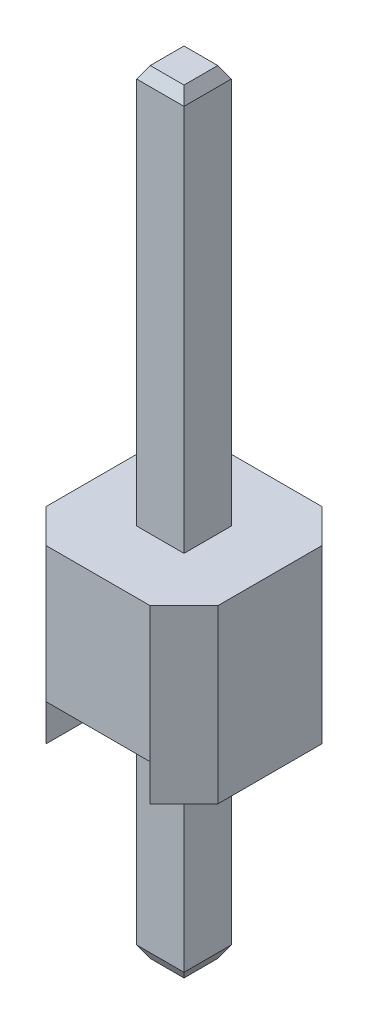
ISO-10303-21;
HEADER;
FILE_DESCRIPTION(('STEP AP214'),'2;1');
FILE_NAME('part.step','',(''),(''),'','','');
FILE_SCHEMA(('AUTOMOTIVE_DESIGN { 1 0 10303 214 1 1 1 1 }'));
ENDSEC;
DATA;
#1=APPLICATION_CONTEXT('core data for automotive mechanical design processes');
#2=APPLICATION_PROTOCOL_DEFINITION('international standard','automotive_design',2000,#1);
#3=PRODUCT_CONTEXT('',#1,'mechanical');
#4=PRODUCT('Part','Part','',(#3));
#5=PRODUCT_RELATED_PRODUCT_CATEGORY('part','',(#4));
#6=PRODUCT_DEFINITION_FORMATION('','',#4);
#7=PRODUCT_DEFINITION_CONTEXT('part definition',#1,'design');
#8=PRODUCT_DEFINITION('design','',#6,#7);
#9=PRODUCT_DEFINITION_SHAPE('','',#8);
#10=(LENGTH_UNIT() NAMED_UNIT(*) SI_UNIT(.MILLI.,.METRE.));
#11=(NAMED_UNIT(*) PLANE_ANGLE_UNIT() SI_UNIT($,.RADIAN.));
#12=(NAMED_UNIT(*) SI_UNIT($,.STERADIAN.) SOLID_ANGLE_UNIT());
#13=UNCERTAINTY_MEASURE_WITH_UNIT(LENGTH_MEASURE(1.E-05),#10,'distance_accuracy_value','');
#14=(GEOMETRIC_REPRESENTATION_CONTEXT(3) GLOBAL_UNCERTAINTY_ASSIGNED_CONTEXT((#13)) GLOBAL_UNIT_ASSIGNED_CONTEXT((#10,
#11,#12)) REPRESENTATION_CONTEXT('',''));
#15=CARTESIAN_POINT('',(0.,0.,0.));
#16=DIRECTION('',(0.,0.,1.));
#17=DIRECTION('',(1.,0.,0.));
#18=AXIS2_PLACEMENT_3D('',#15,#16,#17);
#19=CARTESIAN_POINT('',(-0.35,-2.82679491924311,-0.35));
#20=DIRECTION('',(0.,-0.5,-0.866025403784438));
#21=DIRECTION('',(0.,0.866025403784438,-0.5));
#22=AXIS2_PLACEMENT_3D('',#19,#20,#21);
#23=PLANE('',#22);
#24=DIRECTION('',(0.447213595499958,-0.774596669241483,0.447213595499958));
#25=VECTOR('',#24,1.);
#26=CARTESIAN_POINT('',(-0.35,-2.82679491924311,-0.35));
#27=LINE('',#26,#25);
#28=CARTESIAN_POINT('',(-0.35,-2.82679491924311,-0.35));
#29=VERTEX_POINT('',#28);
#30=CARTESIAN_POINT('',(-0.250000000000001,-3.,-0.250000000000001));
#31=VERTEX_POINT('',#30);
#32=EDGE_CURVE('E19',#29,#31,#27,.T.);
#33=ORIENTED_EDGE('',*,*,#32,.F.);
#34=DIRECTION('',(-1.,0.,0.));
#35=VECTOR('',#34,1.);
#36=CARTESIAN_POINT('',(-0.35,-2.82679491924311,-0.35));
#37=LINE('',#36,#35);
#38=CARTESIAN_POINT('',(0.35,-2.82679491924311,-0.35));
#39=VERTEX_POINT('',#38);
#40=EDGE_CURVE('E188',#39,#29,#37,.T.);
#41=ORIENTED_EDGE('',*,*,#40,.F.);
#42=DIRECTION('',(0.447213595499958,0.774596669241483,-0.447213595499958));
#43=VECTOR('',#42,1.);
#44=CARTESIAN_POINT('',(0.250000000000001,-3.,-0.250000000000001));
#45=LINE('',#44,#43);
#46=CARTESIAN_POINT('',(0.250000000000001,-3.,-0.250000000000001));
#47=VERTEX_POINT('',#46);
#48=EDGE_CURVE('E169',#47,#39,#45,.T.);
#49=ORIENTED_EDGE('',*,*,#48,.F.);
#50=DIRECTION('',(1.,0.,0.));
#51=VECTOR('',#50,1.);
#52=CARTESIAN_POINT('',(0.,-3.,-0.250000000000001));
#53=LINE('',#52,#51);
#54=EDGE_CURVE('E163',#47,#31,#53,.F.);
#55=ORIENTED_EDGE('',*,*,#54,.T.);
#56=EDGE_LOOP('',(#33,#41,#49,#55));
#57=FACE_BOUND('',#56,.T.);
#58=ADVANCED_FACE('F16',(#57),#23,.T.);
#59=CARTESIAN_POINT('',(-0.35,-2.82679491924311,-0.35));
#60=DIRECTION('',(-0.866025403784438,-0.5,0.));
#61=DIRECTION('',(0.5,-0.866025403784438,0.));
#62=AXIS2_PLACEMENT_3D('',#59,#60,#61);
#63=PLANE('',#62);
#64=DIRECTION('',(0.447213595499958,-0.774596669241483,-0.447213595499958));
#65=VECTOR('',#64,1.);
#66=CARTESIAN_POINT('',(-0.35,-2.82679491924311,0.35));
#67=LINE('',#66,#65);
#68=CARTESIAN_POINT('',(-0.35,-2.82679491924311,0.35));
#69=VERTEX_POINT('',#68);
#70=CARTESIAN_POINT('',(-0.250000000000001,-3.,0.250000000000001));
#71=VERTEX_POINT('',#70);
#72=EDGE_CURVE('E201',#69,#71,#67,.T.);
#73=ORIENTED_EDGE('',*,*,#72,.F.);
#74=DIRECTION('',(0.,0.,1.));
#75=VECTOR('',#74,1.);
#76=CARTESIAN_POINT('',(-0.35,-2.82679491924311,-0.35));
#77=LINE('',#76,#75);
#78=EDGE_CURVE('E177',#29,#69,#77,.T.);
#79=ORIENTED_EDGE('',*,*,#78,.F.);
#80=ORIENTED_EDGE('',*,*,#32,.T.);
#81=DIRECTION('',(0.,0.,1.));
#82=VECTOR('',#81,1.);
#83=CARTESIAN_POINT('',(-0.250000000000001,-3.,0.));
#84=LINE('',#83,#82);
#85=EDGE_CURVE('E171',#31,#71,#84,.T.);
#86=ORIENTED_EDGE('',*,*,#85,.T.);
#87=EDGE_LOOP('',(#73,#79,#80,#86));
#88=FACE_BOUND('',#87,.T.);
#89=ADVANCED_FACE('F174',(#88),#63,.T.);
#90=CARTESIAN_POINT('',(0.,-3.,0.));
#91=DIRECTION('',(0.,1.,0.));
#92=DIRECTION('',(0.,0.,1.));
#93=AXIS2_PLACEMENT_3D('',#90,#91,#92);
#94=PLANE('',#93);
#95=ORIENTED_EDGE('',*,*,#85,.F.);
#96=ORIENTED_EDGE('',*,*,#54,.F.);
#97=DIRECTION('',(0.,0.,1.));
#98=VECTOR('',#97,1.);
#99=CARTESIAN_POINT('',(0.250000000000001,-3.,-0.35));
#100=LINE('',#99,#98);
#101=CARTESIAN_POINT('',(0.250000000000001,-3.,0.250000000000001));
#102=VERTEX_POINT('',#101);
#103=EDGE_CURVE('E183',#102,#47,#100,.F.);
#104=ORIENTED_EDGE('',*,*,#103,.F.);
#105=DIRECTION('',(1.,0.,0.));
#106=VECTOR('',#105,1.);
#107=CARTESIAN_POINT('',(-0.35,-3.,0.250000000000001));
#108=LINE('',#107,#106);
#109=EDGE_CURVE('E181',#71,#102,#108,.T.);
#110=ORIENTED_EDGE('',*,*,#109,.F.);
#111=EDGE_LOOP('',(#95,#96,#104,#110));
#112=FACE_BOUND('',#111,.T.);
#113=ADVANCED_FACE('F179',(#112),#94,.F.);
#114=CARTESIAN_POINT('',(0.35,-2.82679491924311,-0.35));
#115=DIRECTION('',(0.866025403784438,-0.5,0.));
#116=DIRECTION('',(0.5,0.866025403784438,0.));
#117=AXIS2_PLACEMENT_3D('',#114,#115,#116);
#118=PLANE('',#117);
#119=ORIENTED_EDGE('',*,*,#48,.T.);
#120=DIRECTION('',(0.,0.,-1.));
#121=VECTOR('',#120,1.);
#122=CARTESIAN_POINT('',(0.35,-2.82679491924311,-0.35));
#123=LINE('',#122,#121);
#124=CARTESIAN_POINT('',(0.35,-2.82679491924311,0.35));
#125=VERTEX_POINT('',#124);
#126=EDGE_CURVE('E204',#125,#39,#123,.T.);
#127=ORIENTED_EDGE('',*,*,#126,.F.);
#128=DIRECTION('',(0.447213595499958,0.774596669241483,0.447213595499958));
#129=VECTOR('',#128,1.);
#130=CARTESIAN_POINT('',(0.250000000000001,-3.,0.250000000000001));
#131=LINE('',#130,#129);
#132=EDGE_CURVE('E198',#102,#125,#131,.T.);
#133=ORIENTED_EDGE('',*,*,#132,.F.);
#134=ORIENTED_EDGE('',*,*,#103,.T.);
#135=EDGE_LOOP('',(#119,#127,#133,#134));
#136=FACE_BOUND('',#135,.T.);
#137=ADVANCED_FACE('F680',(#136),#118,.T.);
#138=CARTESIAN_POINT('',(-0.35,-3.,-0.35));
#139=DIRECTION('',(0.,0.,-1.));
#140=DIRECTION('',(-1.,0.,0.));
#141=AXIS2_PLACEMENT_3D('',#138,#139,#140);
#142=PLANE('',#141);
#143=DIRECTION('',(0.,1.,0.));
#144=VECTOR('',#143,1.);
#145=CARTESIAN_POINT('',(-0.35,-3.,-0.35));
#146=LINE('',#145,#144);
#147=CARTESIAN_POINT('',(-0.35,0.54,-0.35));
#148=VERTEX_POINT('',#147);
#149=EDGE_CURVE('E192',#148,#29,#146,.F.);
#150=ORIENTED_EDGE('',*,*,#149,.F.);
#151=DIRECTION('',(-1.,0.,0.));
#152=VECTOR('',#151,1.);
#153=CARTESIAN_POINT('',(-0.35,0.54,-0.35));
#154=LINE('',#153,#152);
#155=CARTESIAN_POINT('',(0.35,0.54,-0.35));
#156=VERTEX_POINT('',#155);
#157=EDGE_CURVE('E190',#148,#156,#154,.F.);
#158=ORIENTED_EDGE('',*,*,#157,.T.);
#159=DIRECTION('',(0.,1.,0.));
#160=VECTOR('',#159,1.);
#161=CARTESIAN_POINT('',(0.35,-3.,-0.35));
#162=LINE('',#161,#160);
#163=EDGE_CURVE('E207',#39,#156,#162,.T.);
#164=ORIENTED_EDGE('',*,*,#163,.F.);
#165=ORIENTED_EDGE('',*,*,#40,.T.);
#166=EDGE_LOOP('',(#150,#158,#164,#165));
#167=FACE_BOUND('',#166,.T.);
#168=ADVANCED_FACE('F670',(#167),#142,.T.);
#169=CARTESIAN_POINT('',(-0.35,-3.,-0.35));
#170=DIRECTION('',(-1.,0.,0.));
#171=DIRECTION('',(0.,0.,1.));
#172=AXIS2_PLACEMENT_3D('',#169,#170,#171);
#173=PLANE('',#172);
#174=DIRECTION('',(0.,1.,0.));
#175=VECTOR('',#174,1.);
#176=CARTESIAN_POINT('',(-0.35,-3.,0.35));
#177=LINE('',#176,#175);
#178=CARTESIAN_POINT('',(-0.35,0.54,0.35));
#179=VERTEX_POINT('',#178);
#180=EDGE_CURVE('E224',#179,#69,#177,.F.);
#181=ORIENTED_EDGE('',*,*,#180,.F.);
#182=DIRECTION('',(0.,0.,1.));
#183=VECTOR('',#182,1.);
#184=CARTESIAN_POINT('',(-0.35,0.54,-0.35));
#185=LINE('',#184,#183);
#186=EDGE_CURVE('E195',#179,#148,#185,.F.);
#187=ORIENTED_EDGE('',*,*,#186,.T.);
#188=ORIENTED_EDGE('',*,*,#149,.T.);
#189=ORIENTED_EDGE('',*,*,#78,.T.);
#190=EDGE_LOOP('',(#181,#187,#188,#189));
#191=FACE_BOUND('',#190,.T.);
#192=ADVANCED_FACE('F660',(#191),#173,.T.);
#193=CARTESIAN_POINT('',(-0.35,-2.82679491924311,0.35));
#194=DIRECTION('',(0.,-0.5,0.866025403784438));
#195=DIRECTION('',(0.,-0.866025403784438,-0.5));
#196=AXIS2_PLACEMENT_3D('',#193,#194,#195);
#197=PLANE('',#196);
#198=ORIENTED_EDGE('',*,*,#72,.T.);
#199=ORIENTED_EDGE('',*,*,#109,.T.);
#200=ORIENTED_EDGE('',*,*,#132,.T.);
#201=DIRECTION('',(1.,0.,0.));
#202=VECTOR('',#201,1.);
#203=CARTESIAN_POINT('',(-0.35,-2.82679491924311,0.35));
#204=LINE('',#203,#202);
#205=EDGE_CURVE('E227',#69,#125,#204,.T.);
#206=ORIENTED_EDGE('',*,*,#205,.F.);
#207=EDGE_LOOP('',(#198,#199,#200,#206));
#208=FACE_BOUND('',#207,.T.);
#209=ADVANCED_FACE('F650',(#208),#197,.T.);
#210=CARTESIAN_POINT('',(0.35,-3.,-0.35));
#211=DIRECTION('',(1.,0.,0.));
#212=DIRECTION('',(0.,0.,-1.));
#213=AXIS2_PLACEMENT_3D('',#210,#211,#212);
#214=PLANE('',#213);
#215=ORIENTED_EDGE('',*,*,#163,.T.);
#216=DIRECTION('',(0.,0.,-1.));
#217=VECTOR('',#216,1.);
#218=CARTESIAN_POINT('',(0.35,0.54,-0.35));
#219=LINE('',#218,#217);
#220=CARTESIAN_POINT('',(0.35,0.54,0.35));
#221=VERTEX_POINT('',#220);
#222=EDGE_CURVE('E210',#156,#221,#219,.F.);
#223=ORIENTED_EDGE('',*,*,#222,.T.);
#224=DIRECTION('',(0.,1.,0.));
#225=VECTOR('',#224,1.);
#226=CARTESIAN_POINT('',(0.35,-3.,0.35));
#227=LINE('',#226,#225);
#228=EDGE_CURVE('E230',#125,#221,#227,.T.);
#229=ORIENTED_EDGE('',*,*,#228,.F.);
#230=ORIENTED_EDGE('',*,*,#126,.T.);
#231=EDGE_LOOP('',(#215,#223,#229,#230));
#232=FACE_BOUND('',#231,.T.);
#233=ADVANCED_FACE('F640',(#232),#214,.T.);
#234=CARTESIAN_POINT('',(0.,0.,0.));
#235=DIRECTION('',(0.,1.,0.));
#236=DIRECTION('',(0.,0.,1.));
#237=AXIS2_PLACEMENT_3D('',#234,#235,#236);
#238=PLANE('',#237);
#239=DIRECTION('',(0.,0.,-1.));
#240=VECTOR('',#239,1.);
#241=CARTESIAN_POINT('',(0.769999999999995,0.,-1.27000000000001));
#242=LINE('',#241,#240);
#243=CARTESIAN_POINT('',(0.769999999999995,0.,1.27));
#244=VERTEX_POINT('',#243);
#245=CARTESIAN_POINT('',(0.769999999999995,0.,-1.27000000000001));
#246=VERTEX_POINT('',#245);
#247=EDGE_CURVE('E233',#244,#246,#242,.T.);
#248=ORIENTED_EDGE('',*,*,#247,.T.);
#249=DIRECTION('',(-0.707106781186547,0.,-0.707106781186548));
#250=VECTOR('',#249,1.);
#251=CARTESIAN_POINT('',(1.27,0.,-0.770000000000004));
#252=LINE('',#251,#250);
#253=CARTESIAN_POINT('',(1.27,0.,-0.770000000000004));
#254=VERTEX_POINT('',#253);
#255=EDGE_CURVE('E214',#254,#246,#252,.T.);
#256=ORIENTED_EDGE('',*,*,#255,.F.);
#257=DIRECTION('',(0.,0.,1.));
#258=VECTOR('',#257,1.);
#259=CARTESIAN_POINT('',(1.27,0.,0.));
#260=LINE('',#259,#258);
#261=CARTESIAN_POINT('',(1.27,0.,0.769999999999994));
#262=VERTEX_POINT('',#261);
#263=EDGE_CURVE('E212',#262,#254,#260,.F.);
#264=ORIENTED_EDGE('',*,*,#263,.F.);
#265=DIRECTION('',(0.707106781186548,0.,-0.707106781186547));
#266=VECTOR('',#265,1.);
#267=CARTESIAN_POINT('',(0.769999999999995,0.,1.27));
#268=LINE('',#267,#266);
#269=EDGE_CURVE('E216',#244,#262,#268,.T.);
#270=ORIENTED_EDGE('',*,*,#269,.F.);
#271=EDGE_LOOP('',(#248,#256,#264,#270));
#272=FACE_BOUND('',#271,.T.);
#273=ADVANCED_FACE('F630',(#272),#238,.F.);
#274=CARTESIAN_POINT('',(0.,0.,0.));
#275=DIRECTION('',(0.,1.,0.));
#276=DIRECTION('',(0.,0.,1.));
#277=AXIS2_PLACEMENT_3D('',#274,#275,#276);
#278=PLANE('',#277);
#279=DIRECTION('',(0.,0.,1.));
#280=VECTOR('',#279,1.);
#281=CARTESIAN_POINT('',(-0.770000000000004,0.,-1.27000000000001));
#282=LINE('',#281,#280);
#283=CARTESIAN_POINT('',(-0.770000000000003,0.,-1.27000000000001));
#284=VERTEX_POINT('',#283);
#285=CARTESIAN_POINT('',(-0.770000000000004,0.,1.27));
#286=VERTEX_POINT('',#285);
#287=EDGE_CURVE('E243',#284,#286,#282,.T.);
#288=ORIENTED_EDGE('',*,*,#287,.T.);
#289=DIRECTION('',(0.707106781186546,0.,0.707106781186549));
#290=VECTOR('',#289,1.);
#291=CARTESIAN_POINT('',(-1.27,0.,0.769999999999993));
#292=LINE('',#291,#290);
#293=CARTESIAN_POINT('',(-1.27,0.,0.769999999999993));
#294=VERTEX_POINT('',#293);
#295=EDGE_CURVE('E220',#294,#286,#292,.T.);
#296=ORIENTED_EDGE('',*,*,#295,.F.);
#297=DIRECTION('',(0.,0.,1.));
#298=VECTOR('',#297,1.);
#299=CARTESIAN_POINT('',(-1.27,0.,0.));
#300=LINE('',#299,#298);
#301=CARTESIAN_POINT('',(-1.27,0.,-0.770000000000006));
#302=VERTEX_POINT('',#301);
#303=EDGE_CURVE('E218',#302,#294,#300,.T.);
#304=ORIENTED_EDGE('',*,*,#303,.F.);
#305=DIRECTION('',(-0.707106781186547,0.,0.707106781186547));
#306=VECTOR('',#305,1.);
#307=CARTESIAN_POINT('',(-0.770000000000004,0.,-1.27000000000001));
#308=LINE('',#307,#306);
#309=EDGE_CURVE('E222',#284,#302,#308,.T.);
#310=ORIENTED_EDGE('',*,*,#309,.F.);
#311=EDGE_LOOP('',(#288,#296,#304,#310));
#312=FACE_BOUND('',#311,.T.);
#313=ADVANCED_FACE('F620',(#312),#278,.F.);
#314=CARTESIAN_POINT('',(-0.35,-3.,0.35));
#315=DIRECTION('',(0.,0.,1.));
#316=DIRECTION('',(1.,0.,0.));
#317=AXIS2_PLACEMENT_3D('',#314,#315,#316);
#318=PLANE('',#317);
#319=ORIENTED_EDGE('',*,*,#228,.T.);
#320=DIRECTION('',(1.,0.,0.));
#321=VECTOR('',#320,1.);
#322=CARTESIAN_POINT('',(-0.770000000000004,0.54,0.35));
#323=LINE('',#322,#321);
#324=EDGE_CURVE('E248',#221,#179,#323,.F.);
#325=ORIENTED_EDGE('',*,*,#324,.T.);
#326=ORIENTED_EDGE('',*,*,#180,.T.);
#327=ORIENTED_EDGE('',*,*,#205,.T.);
#328=EDGE_LOOP('',(#319,#325,#326,#327));
#329=FACE_BOUND('',#328,.T.);
#330=ADVANCED_FACE('F610',(#329),#318,.T.);
#331=CARTESIAN_POINT('',(0.769999999999995,0.,-1.27000000000001));
#332=DIRECTION('',(1.,0.,0.));
#333=DIRECTION('',(0.,0.,-1.));
#334=AXIS2_PLACEMENT_3D('',#331,#332,#333);
#335=PLANE('',#334);
#336=DIRECTION('',(0.,0.,1.));
#337=VECTOR('',#336,1.);
#338=CARTESIAN_POINT('',(0.769999999999995,0.54,-1.27000000000001));
#339=LINE('',#338,#337);
#340=CARTESIAN_POINT('',(0.769999999999995,0.54,1.27));
#341=VERTEX_POINT('',#340);
#342=CARTESIAN_POINT('',(0.769999999999995,0.54,-1.27000000000001));
#343=VERTEX_POINT('',#342);
#344=EDGE_CURVE('E251',#341,#343,#339,.F.);
#345=ORIENTED_EDGE('',*,*,#344,.T.);
#346=DIRECTION('',(0.,1.,0.));
#347=VECTOR('',#346,1.);
#348=CARTESIAN_POINT('',(0.769999999999995,0.,-1.27000000000001));
#349=LINE('',#348,#347);
#350=EDGE_CURVE('E236',#246,#343,#349,.T.);
#351=ORIENTED_EDGE('',*,*,#350,.F.);
#352=ORIENTED_EDGE('',*,*,#247,.F.);
#353=DIRECTION('',(0.,1.,0.));
#354=VECTOR('',#353,1.);
#355=CARTESIAN_POINT('',(0.769999999999995,0.,1.27));
#356=LINE('',#355,#354);
#357=EDGE_CURVE('E238',#341,#244,#356,.F.);
#358=ORIENTED_EDGE('',*,*,#357,.F.);
#359=EDGE_LOOP('',(#345,#351,#352,#358));
#360=FACE_BOUND('',#359,.T.);
#361=ADVANCED_FACE('F600',(#360),#335,.F.);
#362=CARTESIAN_POINT('',(-0.770000000000004,0.,-1.27000000000001));
#363=DIRECTION('',(-1.,0.,0.));
#364=DIRECTION('',(0.,0.,1.));
#365=AXIS2_PLACEMENT_3D('',#362,#363,#364);
#366=PLANE('',#365);
#367=ORIENTED_EDGE('',*,*,#287,.F.);
#368=DIRECTION('',(0.,1.,0.));
#369=VECTOR('',#368,1.);
#370=CARTESIAN_POINT('',(-0.770000000000004,0.,-1.27000000000001));
#371=LINE('',#370,#369);
#372=CARTESIAN_POINT('',(-0.770000000000004,0.54,-1.27000000000001));
#373=VERTEX_POINT('',#372);
#374=EDGE_CURVE('E241',#373,#284,#371,.F.);
#375=ORIENTED_EDGE('',*,*,#374,.F.);
#376=DIRECTION('',(0.,0.,1.));
#377=VECTOR('',#376,1.);
#378=CARTESIAN_POINT('',(-0.770000000000004,0.54,-1.27000000000001));
#379=LINE('',#378,#377);
#380=CARTESIAN_POINT('',(-0.770000000000004,0.54,1.27));
#381=VERTEX_POINT('',#380);
#382=EDGE_CURVE('E254',#373,#381,#379,.T.);
#383=ORIENTED_EDGE('',*,*,#382,.T.);
#384=DIRECTION('',(0.,1.,0.));
#385=VECTOR('',#384,1.);
#386=CARTESIAN_POINT('',(-0.770000000000004,0.,1.27));
#387=LINE('',#386,#385);
#388=EDGE_CURVE('E246',#286,#381,#387,.T.);
#389=ORIENTED_EDGE('',*,*,#388,.F.);
#390=EDGE_LOOP('',(#367,#375,#383,#389));
#391=FACE_BOUND('',#390,.T.);
#392=ADVANCED_FACE('F590',(#391),#366,.F.);
#393=CARTESIAN_POINT('',(-0.770000000000004,0.54,-1.27000000000001));
#394=DIRECTION('',(0.,1.,0.));
#395=DIRECTION('',(0.,0.,1.));
#396=AXIS2_PLACEMENT_3D('',#393,#394,#395);
#397=PLANE('',#396);
#398=ORIENTED_EDGE('',*,*,#382,.F.);
#399=DIRECTION('',(1.,0.,0.));
#400=VECTOR('',#399,1.);
#401=CARTESIAN_POINT('',(-1.27,0.54,-1.27000000000001));
#402=LINE('',#401,#400);
#403=EDGE_CURVE('E262',#373,#343,#402,.T.);
#404=ORIENTED_EDGE('',*,*,#403,.T.);
#405=ORIENTED_EDGE('',*,*,#344,.F.);
#406=DIRECTION('',(1.,0.,0.));
#407=VECTOR('',#406,1.);
#408=CARTESIAN_POINT('',(-0.770000000000004,0.54,1.27));
#409=LINE('',#408,#407);
#410=EDGE_CURVE('E257',#381,#341,#409,.T.);
#411=ORIENTED_EDGE('',*,*,#410,.F.);
#412=EDGE_LOOP('',(#398,#404,#405,#411));
#413=FACE_BOUND('',#412,.T.);
#414=ORIENTED_EDGE('',*,*,#222,.F.);
#415=ORIENTED_EDGE('',*,*,#157,.F.);
#416=ORIENTED_EDGE('',*,*,#186,.F.);
#417=ORIENTED_EDGE('',*,*,#324,.F.);
#418=EDGE_LOOP('',(#414,#415,#416,#417));
#419=FACE_BOUND('',#418,.T.);
#420=ADVANCED_FACE('F580',(#413,#419),#397,.F.);
#421=CARTESIAN_POINT('',(-1.27,2.54,-1.27000000000001));
#422=DIRECTION('',(0.,0.,1.));
#423=DIRECTION('',(1.,0.,0.));
#424=AXIS2_PLACEMENT_3D('',#421,#422,#423);
#425=PLANE('',#424);
#426=ORIENTED_EDGE('',*,*,#403,.F.);
#427=DIRECTION('',(0.,1.,0.));
#428=VECTOR('',#427,1.);
#429=CARTESIAN_POINT('',(-0.770000000000003,2.54,-1.27000000000001));
#430=LINE('',#429,#428);
#431=CARTESIAN_POINT('',(-0.770000000000003,2.54,-1.27000000000001));
#432=VERTEX_POINT('',#431);
#433=EDGE_CURVE('E271',#373,#432,#430,.T.);
#434=ORIENTED_EDGE('',*,*,#433,.T.);
#435=DIRECTION('',(1.,0.,0.));
#436=VECTOR('',#435,1.);
#437=CARTESIAN_POINT('',(-1.27,2.54,-1.27000000000001));
#438=LINE('',#437,#436);
#439=CARTESIAN_POINT('',(0.769999999999995,2.54,-1.27000000000001));
#440=VERTEX_POINT('',#439);
#441=EDGE_CURVE('E260',#440,#432,#438,.F.);
#442=ORIENTED_EDGE('',*,*,#441,.F.);
#443=DIRECTION('',(0.,1.,0.));
#444=VECTOR('',#443,1.);
#445=CARTESIAN_POINT('',(0.769999999999995,2.54,-1.27000000000001));
#446=LINE('',#445,#444);
#447=EDGE_CURVE('E265',#440,#343,#446,.F.);
#448=ORIENTED_EDGE('',*,*,#447,.T.);
#449=EDGE_LOOP('',(#426,#434,#442,#448));
#450=FACE_BOUND('',#449,.T.);
#451=ADVANCED_FACE('F571',(#450),#425,.F.);
#452=CARTESIAN_POINT('',(0.,8.44,0.25));
#453=DIRECTION('',(0.,-0.5,-0.866025403784439));
#454=DIRECTION('',(0.,0.866025403784439,-0.5));
#455=AXIS2_PLACEMENT_3D('',#452,#453,#454);
#456=PLANE('',#455);
#457=DIRECTION('',(1.,0.,0.));
#458=VECTOR('',#457,1.);
#459=CARTESIAN_POINT('',(0.,8.44,0.25));
#460=LINE('',#459,#458);
#461=CARTESIAN_POINT('',(-0.25,8.44,0.25));
#462=VERTEX_POINT('',#461);
#463=CARTESIAN_POINT('',(0.25,8.44,0.25));
#464=VERTEX_POINT('',#463);
#465=EDGE_CURVE('E276',#462,#464,#460,.T.);
#466=ORIENTED_EDGE('',*,*,#465,.F.);
#467=DIRECTION('',(-0.447213595499958,-0.774596669241484,0.447213595499958));
#468=VECTOR('',#467,1.);
#469=CARTESIAN_POINT('',(-0.25,8.44,0.25));
#470=LINE('',#469,#468);
#471=CARTESIAN_POINT('',(-0.35,8.26679491924311,0.35));
#472=VERTEX_POINT('',#471);
#473=EDGE_CURVE('E281',#462,#472,#470,.T.);
#474=ORIENTED_EDGE('',*,*,#473,.T.);
#475=DIRECTION('',(1.,0.,0.));
#476=VECTOR('',#475,1.);
#477=CARTESIAN_POINT('',(-0.35,8.26679491924311,0.35));
#478=LINE('',#477,#476);
#479=CARTESIAN_POINT('',(0.35,8.26679491924311,0.35));
#480=VERTEX_POINT('',#479);
#481=EDGE_CURVE('E288',#480,#472,#478,.F.);
#482=ORIENTED_EDGE('',*,*,#481,.F.);
#483=DIRECTION('',(-0.447213595499958,0.774596669241484,-0.447213595499958));
#484=VECTOR('',#483,1.);
#485=CARTESIAN_POINT('',(0.35,8.26679491924311,0.35));
#486=LINE('',#485,#484);
#487=EDGE_CURVE('E285',#480,#464,#486,.T.);
#488=ORIENTED_EDGE('',*,*,#487,.T.);
#489=EDGE_LOOP('',(#466,#474,#482,#488));
#490=FACE_BOUND('',#489,.T.);
#491=ADVANCED_FACE('F381',(#490),#456,.F.);
#492=CARTESIAN_POINT('',(0.769999999999996,2.54,-1.27000000000001));
#493=DIRECTION('',(-0.707106781186548,0.,0.707106781186547));
#494=DIRECTION('',(0.707106781186547,0.,0.707106781186548));
#495=AXIS2_PLACEMENT_3D('',#492,#493,#494);
#496=PLANE('',#495);
#497=DIRECTION('',(0.,1.,0.));
#498=VECTOR('',#497,1.);
#499=CARTESIAN_POINT('',(1.27,2.54,-0.770000000000004));
#500=LINE('',#499,#498);
#501=CARTESIAN_POINT('',(1.27,2.54,-0.770000000000004));
#502=VERTEX_POINT('',#501);
#503=EDGE_CURVE('E295',#502,#254,#500,.F.);
#504=ORIENTED_EDGE('',*,*,#503,.T.);
#505=ORIENTED_EDGE('',*,*,#255,.T.);
#506=ORIENTED_EDGE('',*,*,#350,.T.);
#507=ORIENTED_EDGE('',*,*,#447,.F.);
#508=DIRECTION('',(0.707106781186547,0.,0.707106781186548));
#509=VECTOR('',#508,1.);
#510=CARTESIAN_POINT('',(0.769999999999996,2.54,-1.27000000000001));
#511=LINE('',#510,#509);
#512=EDGE_CURVE('E268',#502,#440,#511,.F.);
#513=ORIENTED_EDGE('',*,*,#512,.F.);
#514=EDGE_LOOP('',(#504,#505,#506,#507,#513));
#515=FACE_BOUND('',#514,.T.);
#516=ADVANCED_FACE('F395',(#515),#496,.F.);
#517=CARTESIAN_POINT('',(-1.27,2.54,-0.770000000000005));
#518=DIRECTION('',(0.707106781186547,0.,0.707106781186548));
#519=DIRECTION('',(0.707106781186548,0.,-0.707106781186547));
#520=AXIS2_PLACEMENT_3D('',#517,#518,#519);
#521=PLANE('',#520);
#522=ORIENTED_EDGE('',*,*,#433,.F.);
#523=ORIENTED_EDGE('',*,*,#374,.T.);
#524=ORIENTED_EDGE('',*,*,#309,.T.);
#525=DIRECTION('',(0.,1.,0.));
#526=VECTOR('',#525,1.);
#527=CARTESIAN_POINT('',(-1.27,2.54,-0.770000000000005));
#528=LINE('',#527,#526);
#529=CARTESIAN_POINT('',(-1.27,2.54,-0.770000000000005));
#530=VERTEX_POINT('',#529);
#531=EDGE_CURVE('E298',#302,#530,#528,.T.);
#532=ORIENTED_EDGE('',*,*,#531,.T.);
#533=DIRECTION('',(0.707106781186548,0.,-0.707106781186547));
#534=VECTOR('',#533,1.);
#535=CARTESIAN_POINT('',(-1.27,2.54,-0.770000000000005));
#536=LINE('',#535,#534);
#537=EDGE_CURVE('E274',#432,#530,#536,.F.);
#538=ORIENTED_EDGE('',*,*,#537,.F.);
#539=EDGE_LOOP('',(#522,#523,#524,#532,#538));
#540=FACE_BOUND('',#539,.T.);
#541=ADVANCED_FACE('F387',(#540),#521,.F.);
#542=CARTESIAN_POINT('',(0.,8.44,0.));
#543=DIRECTION('',(0.,1.,0.));
#544=DIRECTION('',(0.,0.,1.));
#545=AXIS2_PLACEMENT_3D('',#542,#543,#544);
#546=PLANE('',#545);
#547=ORIENTED_EDGE('',*,*,#465,.T.);
#548=DIRECTION('',(0.,0.,1.));
#549=VECTOR('',#548,1.);
#550=CARTESIAN_POINT('',(0.25,8.44,0.));
#551=LINE('',#550,#549);
#552=CARTESIAN_POINT('',(0.25,8.44,-0.25));
#553=VERTEX_POINT('',#552);
#554=EDGE_CURVE('E283',#464,#553,#551,.F.);
#555=ORIENTED_EDGE('',*,*,#554,.T.);
#556=DIRECTION('',(1.,0.,0.));
#557=VECTOR('',#556,1.);
#558=CARTESIAN_POINT('',(0.,8.44,-0.25));
#559=LINE('',#558,#557);
#560=CARTESIAN_POINT('',(-0.25,8.44,-0.25));
#561=VERTEX_POINT('',#560);
#562=EDGE_CURVE('E312',#553,#561,#559,.F.);
#563=ORIENTED_EDGE('',*,*,#562,.T.);
#564=DIRECTION('',(0.,0.,1.));
#565=VECTOR('',#564,1.);
#566=CARTESIAN_POINT('',(-0.25,8.44,0.));
#567=LINE('',#566,#565);
#568=EDGE_CURVE('E278',#561,#462,#567,.T.);
#569=ORIENTED_EDGE('',*,*,#568,.T.);
#570=EDGE_LOOP('',(#547,#555,#563,#569));
#571=FACE_BOUND('',#570,.T.);
#572=ADVANCED_FACE('F385',(#571),#546,.T.);
#573=CARTESIAN_POINT('',(-0.25,8.44,0.));
#574=DIRECTION('',(0.866025403784439,-0.5,0.));
#575=DIRECTION('',(0.5,0.866025403784439,0.));
#576=AXIS2_PLACEMENT_3D('',#573,#574,#575);
#577=PLANE('',#576);
#578=DIRECTION('',(0.,0.,1.));
#579=VECTOR('',#578,1.);
#580=CARTESIAN_POINT('',(-0.35,8.26679491924311,-0.35));
#581=LINE('',#580,#579);
#582=CARTESIAN_POINT('',(-0.35,8.26679491924311,-0.35));
#583=VERTEX_POINT('',#582);
#584=EDGE_CURVE('E306',#472,#583,#581,.F.);
#585=ORIENTED_EDGE('',*,*,#584,.F.);
#586=ORIENTED_EDGE('',*,*,#473,.F.);
#587=ORIENTED_EDGE('',*,*,#568,.F.);
#588=DIRECTION('',(-0.447213595499958,-0.774596669241484,-0.447213595499958));
#589=VECTOR('',#588,1.);
#590=CARTESIAN_POINT('',(-0.25,8.44,-0.25));
#591=LINE('',#590,#589);
#592=EDGE_CURVE('E314',#561,#583,#591,.T.);
#593=ORIENTED_EDGE('',*,*,#592,.T.);
#594=EDGE_LOOP('',(#585,#586,#587,#593));
#595=FACE_BOUND('',#594,.T.);
#596=ADVANCED_FACE('F383',(#595),#577,.F.);
#597=CARTESIAN_POINT('',(0.25,8.44,0.));
#598=DIRECTION('',(-0.866025403784439,-0.5,0.));
#599=DIRECTION('',(0.5,-0.866025403784439,0.));
#600=AXIS2_PLACEMENT_3D('',#597,#598,#599);
#601=PLANE('',#600);
#602=DIRECTION('',(0.,0.,-1.));
#603=VECTOR('',#602,1.);
#604=CARTESIAN_POINT('',(0.35,8.26679491924311,-0.35));
#605=LINE('',#604,#603);
#606=CARTESIAN_POINT('',(0.35,8.26679491924311,-0.35));
#607=VERTEX_POINT('',#606);
#608=EDGE_CURVE('E319',#607,#480,#605,.F.);
#609=ORIENTED_EDGE('',*,*,#608,.F.);
#610=DIRECTION('',(-0.447213595499958,0.774596669241484,0.447213595499958));
#611=VECTOR('',#610,1.);
#612=CARTESIAN_POINT('',(0.35,8.26679491924311,-0.35));
#613=LINE('',#612,#611);
#614=EDGE_CURVE('E316',#607,#553,#613,.T.);
#615=ORIENTED_EDGE('',*,*,#614,.T.);
#616=ORIENTED_EDGE('',*,*,#554,.F.);
#617=ORIENTED_EDGE('',*,*,#487,.F.);
#618=EDGE_LOOP('',(#609,#615,#616,#617));
#619=FACE_BOUND('',#618,.T.);
#620=ADVANCED_FACE('F378',(#619),#601,.F.);
#621=CARTESIAN_POINT('',(-0.35,-3.,0.35));
#622=DIRECTION('',(0.,0.,1.));
#623=DIRECTION('',(1.,0.,0.));
#624=AXIS2_PLACEMENT_3D('',#621,#622,#623);
#625=PLANE('',#624);
#626=DIRECTION('',(0.,1.,0.));
#627=VECTOR('',#626,1.);
#628=CARTESIAN_POINT('',(-0.35,-3.,0.35));
#629=LINE('',#628,#627);
#630=CARTESIAN_POINT('',(-0.35,2.54,0.35));
#631=VERTEX_POINT('',#630);
#632=EDGE_CURVE('E303',#631,#472,#629,.T.);
#633=ORIENTED_EDGE('',*,*,#632,.F.);
#634=DIRECTION('',(1.,0.,0.));
#635=VECTOR('',#634,1.);
#636=CARTESIAN_POINT('',(-0.35,2.54,0.35));
#637=LINE('',#636,#635);
#638=CARTESIAN_POINT('',(0.35,2.54,0.35));
#639=VERTEX_POINT('',#638);
#640=EDGE_CURVE('E291',#631,#639,#637,.T.);
#641=ORIENTED_EDGE('',*,*,#640,.T.);
#642=DIRECTION('',(0.,1.,0.));
#643=VECTOR('',#642,1.);
#644=CARTESIAN_POINT('',(0.35,-3.,0.35));
#645=LINE('',#644,#643);
#646=EDGE_CURVE('E322',#480,#639,#645,.F.);
#647=ORIENTED_EDGE('',*,*,#646,.F.);
#648=ORIENTED_EDGE('',*,*,#481,.T.);
#649=EDGE_LOOP('',(#633,#641,#647,#648));
#650=FACE_BOUND('',#649,.T.);
#651=ADVANCED_FACE('F365',(#650),#625,.T.);
#652=CARTESIAN_POINT('',(1.27,2.54,-1.27000000000001));
#653=DIRECTION('',(-1.,0.,0.));
#654=DIRECTION('',(0.,0.,1.));
#655=AXIS2_PLACEMENT_3D('',#652,#653,#654);
#656=PLANE('',#655);
#657=ORIENTED_EDGE('',*,*,#503,.F.);
#658=DIRECTION('',(0.,0.,1.));
#659=VECTOR('',#658,1.);
#660=CARTESIAN_POINT('',(1.27,2.54,-1.27000000000001));
#661=LINE('',#660,#659);
#662=CARTESIAN_POINT('',(1.27,2.54,0.769999999999994));
#663=VERTEX_POINT('',#662);
#664=EDGE_CURVE('E293',#663,#502,#661,.F.);
#665=ORIENTED_EDGE('',*,*,#664,.F.);
#666=DIRECTION('',(0.,1.,0.));
#667=VECTOR('',#666,1.);
#668=CARTESIAN_POINT('',(1.27,2.54,0.769999999999995));
#669=LINE('',#668,#667);
#670=EDGE_CURVE('E327',#663,#262,#669,.F.);
#671=ORIENTED_EDGE('',*,*,#670,.T.);
#672=ORIENTED_EDGE('',*,*,#263,.T.);
#673=EDGE_LOOP('',(#657,#665,#671,#672));
#674=FACE_BOUND('',#673,.T.);
#675=ADVANCED_FACE('F426',(#674),#656,.F.);
#676=CARTESIAN_POINT('',(-1.27,2.54,-1.27000000000001));
#677=DIRECTION('',(1.,0.,0.));
#678=DIRECTION('',(0.,0.,-1.));
#679=AXIS2_PLACEMENT_3D('',#676,#677,#678);
#680=PLANE('',#679);
#681=ORIENTED_EDGE('',*,*,#531,.F.);
#682=ORIENTED_EDGE('',*,*,#303,.T.);
#683=DIRECTION('',(0.,1.,0.));
#684=VECTOR('',#683,1.);
#685=CARTESIAN_POINT('',(-1.27,2.54,0.769999999999993));
#686=LINE('',#685,#684);
#687=CARTESIAN_POINT('',(-1.27,2.54,0.769999999999993));
#688=VERTEX_POINT('',#687);
#689=EDGE_CURVE('E331',#294,#688,#686,.T.);
#690=ORIENTED_EDGE('',*,*,#689,.T.);
#691=DIRECTION('',(0.,0.,-1.));
#692=VECTOR('',#691,1.);
#693=CARTESIAN_POINT('',(-1.27,2.54,-1.27000000000001));
#694=LINE('',#693,#692);
#695=EDGE_CURVE('E301',#530,#688,#694,.F.);
#696=ORIENTED_EDGE('',*,*,#695,.F.);
#697=EDGE_LOOP('',(#681,#682,#690,#696));
#698=FACE_BOUND('',#697,.T.);
#699=ADVANCED_FACE('F423',(#698),#680,.F.);
#700=CARTESIAN_POINT('',(-0.35,-3.,-0.35));
#701=DIRECTION('',(-1.,0.,0.));
#702=DIRECTION('',(0.,0.,1.));
#703=AXIS2_PLACEMENT_3D('',#700,#701,#702);
#704=PLANE('',#703);
#705=DIRECTION('',(0.,1.,0.));
#706=VECTOR('',#705,1.);
#707=CARTESIAN_POINT('',(-0.35,-3.,-0.35));
#708=LINE('',#707,#706);
#709=CARTESIAN_POINT('',(-0.35,2.54,-0.35));
#710=VERTEX_POINT('',#709);
#711=EDGE_CURVE('E336',#710,#583,#708,.T.);
#712=ORIENTED_EDGE('',*,*,#711,.F.);
#713=DIRECTION('',(0.,0.,1.));
#714=VECTOR('',#713,1.);
#715=CARTESIAN_POINT('',(-0.35,2.54,-0.35));
#716=LINE('',#715,#714);
#717=EDGE_CURVE('E309',#710,#631,#716,.T.);
#718=ORIENTED_EDGE('',*,*,#717,.T.);
#719=ORIENTED_EDGE('',*,*,#632,.T.);
#720=ORIENTED_EDGE('',*,*,#584,.T.);
#721=EDGE_LOOP('',(#712,#718,#719,#720));
#722=FACE_BOUND('',#721,.T.);
#723=ADVANCED_FACE('F368',(#722),#704,.T.);
#724=CARTESIAN_POINT('',(0.,8.44,-0.25));
#725=DIRECTION('',(0.,-0.5,0.866025403784439));
#726=DIRECTION('',(0.,-0.866025403784439,-0.5));
#727=AXIS2_PLACEMENT_3D('',#724,#725,#726);
#728=PLANE('',#727);
#729=DIRECTION('',(-1.,0.,0.));
#730=VECTOR('',#729,1.);
#731=CARTESIAN_POINT('',(-0.35,8.26679491924311,-0.35));
#732=LINE('',#731,#730);
#733=EDGE_CURVE('E339',#583,#607,#732,.F.);
#734=ORIENTED_EDGE('',*,*,#733,.F.);
#735=ORIENTED_EDGE('',*,*,#592,.F.);
#736=ORIENTED_EDGE('',*,*,#562,.F.);
#737=ORIENTED_EDGE('',*,*,#614,.F.);
#738=EDGE_LOOP('',(#734,#735,#736,#737));
#739=FACE_BOUND('',#738,.T.);
#740=ADVANCED_FACE('F374',(#739),#728,.F.);
#741=CARTESIAN_POINT('',(0.35,-3.,-0.35));
#742=DIRECTION('',(1.,0.,0.));
#743=DIRECTION('',(0.,0.,-1.));
#744=AXIS2_PLACEMENT_3D('',#741,#742,#743);
#745=PLANE('',#744);
#746=ORIENTED_EDGE('',*,*,#646,.T.);
#747=DIRECTION('',(0.,0.,-1.));
#748=VECTOR('',#747,1.);
#749=CARTESIAN_POINT('',(0.35,2.54,-0.35));
#750=LINE('',#749,#748);
#751=CARTESIAN_POINT('',(0.35,2.54,-0.35));
#752=VERTEX_POINT('',#751);
#753=EDGE_CURVE('E325',#639,#752,#750,.T.);
#754=ORIENTED_EDGE('',*,*,#753,.T.);
#755=DIRECTION('',(0.,1.,0.));
#756=VECTOR('',#755,1.);
#757=CARTESIAN_POINT('',(0.35,-3.,-0.35));
#758=LINE('',#757,#756);
#759=EDGE_CURVE('E342',#607,#752,#758,.F.);
#760=ORIENTED_EDGE('',*,*,#759,.F.);
#761=ORIENTED_EDGE('',*,*,#608,.T.);
#762=EDGE_LOOP('',(#746,#754,#760,#761));
#763=FACE_BOUND('',#762,.T.);
#764=ADVANCED_FACE('F361',(#763),#745,.T.);
#765=CARTESIAN_POINT('',(1.27,2.54,0.769999999999995));
#766=DIRECTION('',(-0.707106781186547,0.,-0.707106781186548));
#767=DIRECTION('',(-0.707106781186548,0.,0.707106781186547));
#768=AXIS2_PLACEMENT_3D('',#765,#766,#767);
#769=PLANE('',#768);
#770=DIRECTION('',(0.,1.,0.));
#771=VECTOR('',#770,1.);
#772=CARTESIAN_POINT('',(0.769999999999994,2.54,1.27));
#773=LINE('',#772,#771);
#774=CARTESIAN_POINT('',(0.769999999999994,2.54,1.27));
#775=VERTEX_POINT('',#774);
#776=EDGE_CURVE('E345',#775,#341,#773,.F.);
#777=ORIENTED_EDGE('',*,*,#776,.T.);
#778=ORIENTED_EDGE('',*,*,#357,.T.);
#779=ORIENTED_EDGE('',*,*,#269,.T.);
#780=ORIENTED_EDGE('',*,*,#670,.F.);
#781=DIRECTION('',(-0.707106781186548,0.,0.707106781186547));
#782=VECTOR('',#781,1.);
#783=CARTESIAN_POINT('',(1.27,2.54,0.769999999999995));
#784=LINE('',#783,#782);
#785=EDGE_CURVE('E34',#775,#663,#784,.F.);
#786=ORIENTED_EDGE('',*,*,#785,.F.);
#787=EDGE_LOOP('',(#777,#778,#779,#780,#786));
#788=FACE_BOUND('',#787,.T.);
#789=ADVANCED_FACE('F413',(#788),#769,.F.);
#790=CARTESIAN_POINT('',(-0.770000000000004,2.54,1.27));
#791=DIRECTION('',(0.707106781186549,0.,-0.707106781186546));
#792=DIRECTION('',(-0.707106781186546,0.,-0.707106781186549));
#793=AXIS2_PLACEMENT_3D('',#790,#791,#792);
#794=PLANE('',#793);
#795=ORIENTED_EDGE('',*,*,#689,.F.);
#796=ORIENTED_EDGE('',*,*,#295,.T.);
#797=ORIENTED_EDGE('',*,*,#388,.T.);
#798=DIRECTION('',(0.,1.,0.));
#799=VECTOR('',#798,1.);
#800=CARTESIAN_POINT('',(-0.770000000000004,2.54,1.27));
#801=LINE('',#800,#799);
#802=CARTESIAN_POINT('',(-0.770000000000004,2.54,1.27));
#803=VERTEX_POINT('',#802);
#804=EDGE_CURVE('E347',#381,#803,#801,.T.);
#805=ORIENTED_EDGE('',*,*,#804,.T.);
#806=DIRECTION('',(-0.707106781186546,0.,-0.707106781186549));
#807=VECTOR('',#806,1.);
#808=CARTESIAN_POINT('',(-0.770000000000004,2.54,1.27));
#809=LINE('',#808,#807);
#810=EDGE_CURVE('E334',#688,#803,#809,.F.);
#811=ORIENTED_EDGE('',*,*,#810,.F.);
#812=EDGE_LOOP('',(#795,#796,#797,#805,#811));
#813=FACE_BOUND('',#812,.T.);
#814=ADVANCED_FACE('F410',(#813),#794,.F.);
#815=CARTESIAN_POINT('',(-0.35,-3.,-0.35));
#816=DIRECTION('',(0.,0.,-1.));
#817=DIRECTION('',(-1.,0.,0.));
#818=AXIS2_PLACEMENT_3D('',#815,#816,#817);
#819=PLANE('',#818);
#820=ORIENTED_EDGE('',*,*,#759,.T.);
#821=DIRECTION('',(1.,0.,0.));
#822=VECTOR('',#821,1.);
#823=CARTESIAN_POINT('',(0.,2.54,-0.35));
#824=LINE('',#823,#822);
#825=EDGE_CURVE('E25',#710,#752,#824,.T.);
#826=ORIENTED_EDGE('',*,*,#825,.F.);
#827=ORIENTED_EDGE('',*,*,#711,.T.);
#828=ORIENTED_EDGE('',*,*,#733,.T.);
#829=EDGE_LOOP('',(#820,#826,#827,#828));
#830=FACE_BOUND('',#829,.T.);
#831=ADVANCED_FACE('F357',(#830),#819,.T.);
#832=CARTESIAN_POINT('',(-1.27,2.54,1.27));
#833=DIRECTION('',(0.,0.,-1.));
#834=DIRECTION('',(-1.,0.,0.));
#835=AXIS2_PLACEMENT_3D('',#832,#833,#834);
#836=PLANE('',#835);
#837=ORIENTED_EDGE('',*,*,#410,.T.);
#838=ORIENTED_EDGE('',*,*,#776,.F.);
#839=DIRECTION('',(1.,0.,0.));
#840=VECTOR('',#839,1.);
#841=CARTESIAN_POINT('',(0.,2.54,1.27));
#842=LINE('',#841,#840);
#843=EDGE_CURVE('E11',#803,#775,#842,.T.);
#844=ORIENTED_EDGE('',*,*,#843,.F.);
#845=ORIENTED_EDGE('',*,*,#804,.F.);
#846=EDGE_LOOP('',(#837,#838,#844,#845));
#847=FACE_BOUND('',#846,.T.);
#848=ADVANCED_FACE('F399',(#847),#836,.F.);
#849=CARTESIAN_POINT('',(0.,2.54,0.));
#850=DIRECTION('',(0.,1.,0.));
#851=DIRECTION('',(0.,0.,1.));
#852=AXIS2_PLACEMENT_3D('',#849,#850,#851);
#853=PLANE('',#852);
#854=ORIENTED_EDGE('',*,*,#843,.T.);
#855=ORIENTED_EDGE('',*,*,#785,.T.);
#856=ORIENTED_EDGE('',*,*,#664,.T.);
#857=ORIENTED_EDGE('',*,*,#512,.T.);
#858=ORIENTED_EDGE('',*,*,#441,.T.);
#859=ORIENTED_EDGE('',*,*,#537,.T.);
#860=ORIENTED_EDGE('',*,*,#695,.T.);
#861=ORIENTED_EDGE('',*,*,#810,.T.);
#862=EDGE_LOOP('',(#854,#855,#856,#857,#858,#859,#860,#861));
#863=FACE_BOUND('',#862,.T.);
#864=ORIENTED_EDGE('',*,*,#717,.F.);
#865=ORIENTED_EDGE('',*,*,#825,.T.);
#866=ORIENTED_EDGE('',*,*,#753,.F.);
#867=ORIENTED_EDGE('',*,*,#640,.F.);
#868=EDGE_LOOP('',(#864,#865,#866,#867));
#869=FACE_BOUND('',#868,.T.);
#870=ADVANCED_FACE('F354',(#863,#869),#853,.T.);
#871=CLOSED_SHELL('',(#58,#89,#113,#137,#168,#192,#209,#233,#273,#313,#330,#361,#392,#420,#451,
#491,#516,#541,#572,#596,#620,#651,#675,#699,#723,#740,#764,#789,#814,#831,#848,#870));
#872=MANIFOLD_SOLID_BREP('B1',#871);
#873=ADVANCED_BREP_SHAPE_REPRESENTATION('',(#18,#872),#14);
#874=SHAPE_DEFINITION_REPRESENTATION(#9,#873);
ENDSEC;
END-ISO-10303-21;
